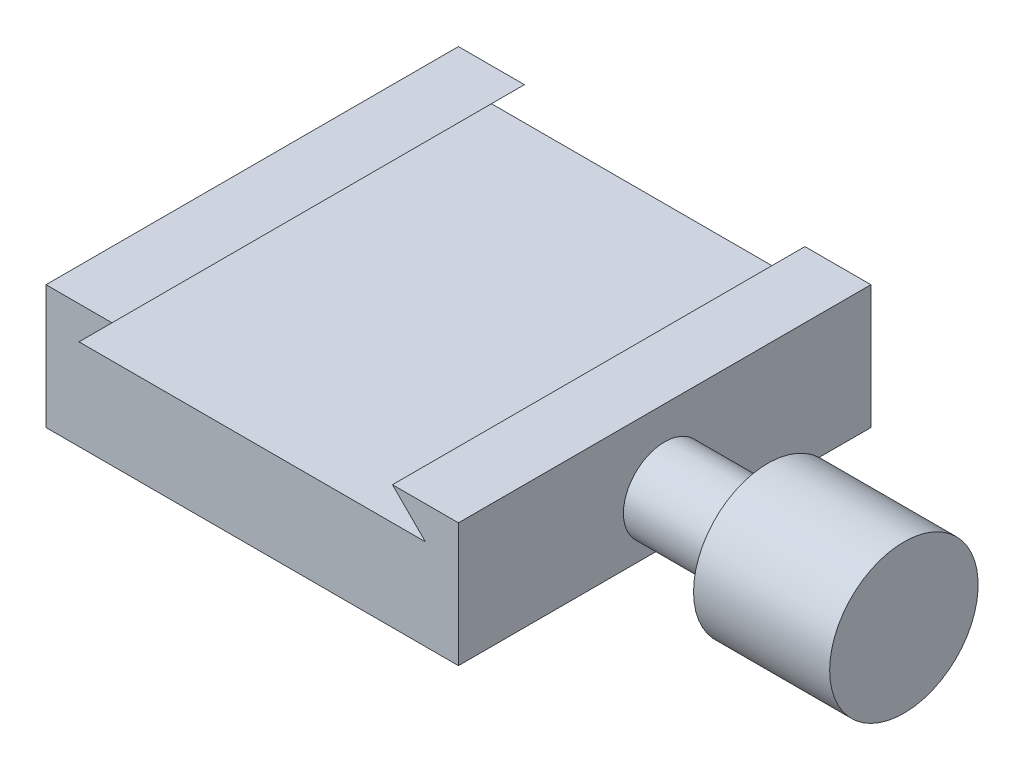
ISO-10303-21;
HEADER;
FILE_DESCRIPTION(('STEP AP214'),'2;1');
FILE_NAME('part.step','',(''),(''),'','','');
FILE_SCHEMA(('AUTOMOTIVE_DESIGN { 1 0 10303 214 1 1 1 1 }'));
ENDSEC;
DATA;
#1=APPLICATION_CONTEXT('core data for automotive mechanical design processes');
#2=APPLICATION_PROTOCOL_DEFINITION('international standard','automotive_design',2000,#1);
#3=PRODUCT_CONTEXT('',#1,'mechanical');
#4=PRODUCT('Part','Part','',(#3));
#5=PRODUCT_RELATED_PRODUCT_CATEGORY('part','',(#4));
#6=PRODUCT_DEFINITION_FORMATION('','',#4);
#7=PRODUCT_DEFINITION_CONTEXT('part definition',#1,'design');
#8=PRODUCT_DEFINITION('design','',#6,#7);
#9=PRODUCT_DEFINITION_SHAPE('','',#8);
#10=(LENGTH_UNIT() NAMED_UNIT(*) SI_UNIT(.MILLI.,.METRE.));
#11=(NAMED_UNIT(*) PLANE_ANGLE_UNIT() SI_UNIT($,.RADIAN.));
#12=(NAMED_UNIT(*) SI_UNIT($,.STERADIAN.) SOLID_ANGLE_UNIT());
#13=UNCERTAINTY_MEASURE_WITH_UNIT(LENGTH_MEASURE(1.E-05),#10,'distance_accuracy_value','');
#14=(GEOMETRIC_REPRESENTATION_CONTEXT(3) GLOBAL_UNCERTAINTY_ASSIGNED_CONTEXT((#13)) GLOBAL_UNIT_ASSIGNED_CONTEXT((#10,
#11,#12)) REPRESENTATION_CONTEXT('',''));
#15=CARTESIAN_POINT('',(0.,0.,0.));
#16=DIRECTION('',(0.,0.,1.));
#17=DIRECTION('',(1.,0.,0.));
#18=AXIS2_PLACEMENT_3D('',#15,#16,#17);
#19=CARTESIAN_POINT('',(50.,0.,50.));
#20=DIRECTION('',(0.,1.,0.));
#21=DIRECTION('',(-1.,0.,0.));
#22=AXIS2_PLACEMENT_3D('',#19,#20,#21);
#23=PLANE('',#22);
#24=CARTESIAN_POINT('',(25.,0.,25.));
#25=DIRECTION('',(0.,-1.,0.));
#26=DIRECTION('',(1.,0.,0.));
#27=AXIS2_PLACEMENT_3D('',#24,#25,#26);
#28=CIRCLE('',#27,4.7625);
#29=CARTESIAN_POINT('',(29.7625,0.,25.));
#30=VERTEX_POINT('',#29);
#31=EDGE_CURVE('E223',#30,#30,#28,.T.);
#32=ORIENTED_EDGE('',*,*,#31,.F.);
#33=EDGE_LOOP('',(#32));
#34=FACE_BOUND('',#33,.T.);
#35=DIRECTION('',(1.,0.,0.));
#36=VECTOR('',#35,1.);
#37=CARTESIAN_POINT('',(50.,0.,0.));
#38=LINE('',#37,#36);
#39=CARTESIAN_POINT('',(0.,0.,0.));
#40=VERTEX_POINT('',#39);
#41=CARTESIAN_POINT('',(50.,0.,0.));
#42=VERTEX_POINT('',#41);
#43=EDGE_CURVE('E140',#40,#42,#38,.T.);
#44=ORIENTED_EDGE('',*,*,#43,.T.);
#45=DIRECTION('',(0.,0.,-1.));
#46=VECTOR('',#45,1.);
#47=CARTESIAN_POINT('',(50.,0.,50.));
#48=LINE('',#47,#46);
#49=CARTESIAN_POINT('',(50.,0.,50.));
#50=VERTEX_POINT('',#49);
#51=EDGE_CURVE('E11',#50,#42,#48,.T.);
#52=ORIENTED_EDGE('',*,*,#51,.F.);
#53=DIRECTION('',(1.,0.,0.));
#54=VECTOR('',#53,1.);
#55=CARTESIAN_POINT('',(50.,0.,50.));
#56=LINE('',#55,#54);
#57=CARTESIAN_POINT('',(0.,0.,50.));
#58=VERTEX_POINT('',#57);
#59=EDGE_CURVE('E163',#58,#50,#56,.T.);
#60=ORIENTED_EDGE('',*,*,#59,.F.);
#61=DIRECTION('',(0.,0.,-1.));
#62=VECTOR('',#61,1.);
#63=CARTESIAN_POINT('',(0.,0.,50.));
#64=LINE('',#63,#62);
#65=EDGE_CURVE('E136',#58,#40,#64,.T.);
#66=ORIENTED_EDGE('',*,*,#65,.T.);
#67=EDGE_LOOP('',(#44,#52,#60,#66));
#68=FACE_BOUND('',#67,.T.);
#69=ADVANCED_FACE('F39',(#34,#68),#23,.F.);
#70=CARTESIAN_POINT('',(50.,15.,50.));
#71=DIRECTION('',(-1.,0.,0.));
#72=DIRECTION('',(0.,0.,1.));
#73=AXIS2_PLACEMENT_3D('',#70,#71,#72);
#74=PLANE('',#73);
#75=CARTESIAN_POINT('',(50.,6.,25.));
#76=DIRECTION('',(-1.,0.,0.));
#77=DIRECTION('',(0.,0.,1.));
#78=AXIS2_PLACEMENT_3D('',#75,#76,#77);
#79=CIRCLE('',#78,5.);
#80=CARTESIAN_POINT('',(50.,6.,30.));
#81=VERTEX_POINT('',#80);
#82=EDGE_CURVE('E145',#81,#81,#79,.T.);
#83=ORIENTED_EDGE('',*,*,#82,.T.);
#84=EDGE_LOOP('',(#83));
#85=FACE_BOUND('',#84,.T.);
#86=DIRECTION('',(0.,1.,0.));
#87=VECTOR('',#86,1.);
#88=CARTESIAN_POINT('',(50.,15.,0.));
#89=LINE('',#88,#87);
#90=CARTESIAN_POINT('',(50.,15.,0.));
#91=VERTEX_POINT('',#90);
#92=EDGE_CURVE('E144',#42,#91,#89,.T.);
#93=ORIENTED_EDGE('',*,*,#92,.T.);
#94=DIRECTION('',(0.,0.,-1.));
#95=VECTOR('',#94,1.);
#96=CARTESIAN_POINT('',(50.,15.,50.));
#97=LINE('',#96,#95);
#98=CARTESIAN_POINT('',(50.,15.,50.));
#99=VERTEX_POINT('',#98);
#100=EDGE_CURVE('E48',#99,#91,#97,.T.);
#101=ORIENTED_EDGE('',*,*,#100,.F.);
#102=DIRECTION('',(0.,1.,0.));
#103=VECTOR('',#102,1.);
#104=CARTESIAN_POINT('',(50.,15.,50.));
#105=LINE('',#104,#103);
#106=EDGE_CURVE('E99',#50,#99,#105,.T.);
#107=ORIENTED_EDGE('',*,*,#106,.F.);
#108=ORIENTED_EDGE('',*,*,#51,.T.);
#109=EDGE_LOOP('',(#93,#101,#107,#108));
#110=FACE_BOUND('',#109,.T.);
#111=ADVANCED_FACE('F242',(#85,#110),#74,.F.);
#112=CARTESIAN_POINT('',(42.,15.,50.));
#113=DIRECTION('',(0.,-1.,0.));
#114=DIRECTION('',(0.,0.,-1.));
#115=AXIS2_PLACEMENT_3D('',#112,#113,#114);
#116=PLANE('',#115);
#117=DIRECTION('',(-1.,0.,0.));
#118=VECTOR('',#117,1.);
#119=CARTESIAN_POINT('',(42.,15.,0.));
#120=LINE('',#119,#118);
#121=CARTESIAN_POINT('',(42.,15.,0.));
#122=VERTEX_POINT('',#121);
#123=EDGE_CURVE('E148',#91,#122,#120,.T.);
#124=ORIENTED_EDGE('',*,*,#123,.T.);
#125=DIRECTION('',(0.,0.,-1.));
#126=VECTOR('',#125,1.);
#127=CARTESIAN_POINT('',(42.,15.,50.));
#128=LINE('',#127,#126);
#129=CARTESIAN_POINT('',(42.,15.,50.));
#130=VERTEX_POINT('',#129);
#131=EDGE_CURVE('E174',#130,#122,#128,.T.);
#132=ORIENTED_EDGE('',*,*,#131,.F.);
#133=DIRECTION('',(-1.,0.,0.));
#134=VECTOR('',#133,1.);
#135=CARTESIAN_POINT('',(42.,15.,50.));
#136=LINE('',#135,#134);
#137=EDGE_CURVE('E184',#99,#130,#136,.T.);
#138=ORIENTED_EDGE('',*,*,#137,.F.);
#139=ORIENTED_EDGE('',*,*,#100,.T.);
#140=EDGE_LOOP('',(#124,#132,#138,#139));
#141=FACE_BOUND('',#140,.T.);
#142=ADVANCED_FACE('F182',(#141),#116,.F.);
#143=CARTESIAN_POINT('',(46.,11.,50.));
#144=DIRECTION('',(0.707106781186548,0.707106781186547,0.));
#145=DIRECTION('',(-0.707106781186547,0.707106781186548,0.));
#146=AXIS2_PLACEMENT_3D('',#143,#144,#145);
#147=PLANE('',#146);
#148=DIRECTION('',(0.707106781186547,-0.707106781186548,0.));
#149=VECTOR('',#148,1.);
#150=CARTESIAN_POINT('',(46.,11.,0.));
#151=LINE('',#150,#149);
#152=CARTESIAN_POINT('',(46.,11.,0.));
#153=VERTEX_POINT('',#152);
#154=EDGE_CURVE('E151',#122,#153,#151,.T.);
#155=ORIENTED_EDGE('',*,*,#154,.T.);
#156=DIRECTION('',(0.,0.,-1.));
#157=VECTOR('',#156,1.);
#158=CARTESIAN_POINT('',(46.,11.,50.));
#159=LINE('',#158,#157);
#160=CARTESIAN_POINT('',(46.,11.,50.));
#161=VERTEX_POINT('',#160);
#162=EDGE_CURVE('E170',#161,#153,#159,.T.);
#163=ORIENTED_EDGE('',*,*,#162,.F.);
#164=DIRECTION('',(0.707106781186547,-0.707106781186548,0.));
#165=VECTOR('',#164,1.);
#166=CARTESIAN_POINT('',(46.,11.,50.));
#167=LINE('',#166,#165);
#168=EDGE_CURVE('E197',#130,#161,#167,.T.);
#169=ORIENTED_EDGE('',*,*,#168,.F.);
#170=ORIENTED_EDGE('',*,*,#131,.T.);
#171=EDGE_LOOP('',(#155,#163,#169,#170));
#172=FACE_BOUND('',#171,.T.);
#173=ADVANCED_FACE('F192',(#172),#147,.F.);
#174=CARTESIAN_POINT('',(4.,11.,50.));
#175=DIRECTION('',(0.,-1.,0.));
#176=DIRECTION('',(0.,0.,-1.));
#177=AXIS2_PLACEMENT_3D('',#174,#175,#176);
#178=PLANE('',#177);
#179=DIRECTION('',(-1.,0.,0.));
#180=VECTOR('',#179,1.);
#181=CARTESIAN_POINT('',(4.,11.,0.));
#182=LINE('',#181,#180);
#183=CARTESIAN_POINT('',(4.,11.,0.));
#184=VERTEX_POINT('',#183);
#185=EDGE_CURVE('E154',#153,#184,#182,.T.);
#186=ORIENTED_EDGE('',*,*,#185,.T.);
#187=DIRECTION('',(0.,0.,-1.));
#188=VECTOR('',#187,1.);
#189=CARTESIAN_POINT('',(4.,11.,50.));
#190=LINE('',#189,#188);
#191=CARTESIAN_POINT('',(4.,11.,50.));
#192=VERTEX_POINT('',#191);
#193=EDGE_CURVE('E129',#192,#184,#190,.T.);
#194=ORIENTED_EDGE('',*,*,#193,.F.);
#195=DIRECTION('',(-1.,0.,0.));
#196=VECTOR('',#195,1.);
#197=CARTESIAN_POINT('',(4.,11.,50.));
#198=LINE('',#197,#196);
#199=EDGE_CURVE('E118',#161,#192,#198,.T.);
#200=ORIENTED_EDGE('',*,*,#199,.F.);
#201=ORIENTED_EDGE('',*,*,#162,.T.);
#202=EDGE_LOOP('',(#186,#194,#200,#201));
#203=FACE_BOUND('',#202,.T.);
#204=ADVANCED_FACE('F195',(#203),#178,.F.);
#205=CARTESIAN_POINT('',(8.,15.,50.));
#206=DIRECTION('',(-0.707106781186548,0.707106781186548,0.));
#207=DIRECTION('',(-0.707106781186548,-0.707106781186548,0.));
#208=AXIS2_PLACEMENT_3D('',#205,#206,#207);
#209=PLANE('',#208);
#210=DIRECTION('',(0.707106781186548,0.707106781186548,0.));
#211=VECTOR('',#210,1.);
#212=CARTESIAN_POINT('',(8.,15.,0.));
#213=LINE('',#212,#211);
#214=CARTESIAN_POINT('',(8.,15.,0.));
#215=VERTEX_POINT('',#214);
#216=EDGE_CURVE('E127',#184,#215,#213,.T.);
#217=ORIENTED_EDGE('',*,*,#216,.T.);
#218=DIRECTION('',(0.,0.,-1.));
#219=VECTOR('',#218,1.);
#220=CARTESIAN_POINT('',(8.,15.,50.));
#221=LINE('',#220,#219);
#222=CARTESIAN_POINT('',(8.,15.,50.));
#223=VERTEX_POINT('',#222);
#224=EDGE_CURVE('E124',#223,#215,#221,.T.);
#225=ORIENTED_EDGE('',*,*,#224,.F.);
#226=DIRECTION('',(0.707106781186548,0.707106781186548,0.));
#227=VECTOR('',#226,1.);
#228=CARTESIAN_POINT('',(8.,15.,50.));
#229=LINE('',#228,#227);
#230=EDGE_CURVE('E112',#192,#223,#229,.T.);
#231=ORIENTED_EDGE('',*,*,#230,.F.);
#232=ORIENTED_EDGE('',*,*,#193,.T.);
#233=EDGE_LOOP('',(#217,#225,#231,#232));
#234=FACE_BOUND('',#233,.T.);
#235=ADVANCED_FACE('F125',(#234),#209,.F.);
#236=CARTESIAN_POINT('',(0.,15.,50.));
#237=DIRECTION('',(0.,-1.,0.));
#238=DIRECTION('',(0.,0.,-1.));
#239=AXIS2_PLACEMENT_3D('',#236,#237,#238);
#240=PLANE('',#239);
#241=DIRECTION('',(-1.,0.,0.));
#242=VECTOR('',#241,1.);
#243=CARTESIAN_POINT('',(0.,15.,0.));
#244=LINE('',#243,#242);
#245=CARTESIAN_POINT('',(0.,15.,0.));
#246=VERTEX_POINT('',#245);
#247=EDGE_CURVE('E85',#215,#246,#244,.T.);
#248=ORIENTED_EDGE('',*,*,#247,.T.);
#249=DIRECTION('',(0.,0.,-1.));
#250=VECTOR('',#249,1.);
#251=CARTESIAN_POINT('',(0.,15.,50.));
#252=LINE('',#251,#250);
#253=CARTESIAN_POINT('',(0.,15.,50.));
#254=VERTEX_POINT('',#253);
#255=EDGE_CURVE('E130',#254,#246,#252,.T.);
#256=ORIENTED_EDGE('',*,*,#255,.F.);
#257=DIRECTION('',(-1.,0.,0.));
#258=VECTOR('',#257,1.);
#259=CARTESIAN_POINT('',(0.,15.,50.));
#260=LINE('',#259,#258);
#261=EDGE_CURVE('E116',#223,#254,#260,.T.);
#262=ORIENTED_EDGE('',*,*,#261,.F.);
#263=ORIENTED_EDGE('',*,*,#224,.T.);
#264=EDGE_LOOP('',(#248,#256,#262,#263));
#265=FACE_BOUND('',#264,.T.);
#266=ADVANCED_FACE('F132',(#265),#240,.F.);
#267=CARTESIAN_POINT('',(0.,0.,50.));
#268=DIRECTION('',(1.,0.,0.));
#269=DIRECTION('',(0.,0.,-1.));
#270=AXIS2_PLACEMENT_3D('',#267,#268,#269);
#271=PLANE('',#270);
#272=DIRECTION('',(0.,-1.,0.));
#273=VECTOR('',#272,1.);
#274=CARTESIAN_POINT('',(0.,0.,0.));
#275=LINE('',#274,#273);
#276=EDGE_CURVE('E91',#246,#40,#275,.T.);
#277=ORIENTED_EDGE('',*,*,#276,.T.);
#278=ORIENTED_EDGE('',*,*,#65,.F.);
#279=DIRECTION('',(0.,-1.,0.));
#280=VECTOR('',#279,1.);
#281=CARTESIAN_POINT('',(0.,0.,50.));
#282=LINE('',#281,#280);
#283=EDGE_CURVE('E56',#254,#58,#282,.T.);
#284=ORIENTED_EDGE('',*,*,#283,.F.);
#285=ORIENTED_EDGE('',*,*,#255,.T.);
#286=EDGE_LOOP('',(#277,#278,#284,#285));
#287=FACE_BOUND('',#286,.T.);
#288=ADVANCED_FACE('F245',(#287),#271,.F.);
#289=CARTESIAN_POINT('',(0.,0.,50.));
#290=DIRECTION('',(0.,0.,-1.));
#291=DIRECTION('',(-1.,0.,0.));
#292=AXIS2_PLACEMENT_3D('',#289,#290,#291);
#293=PLANE('',#292);
#294=ORIENTED_EDGE('',*,*,#59,.T.);
#295=ORIENTED_EDGE('',*,*,#106,.T.);
#296=ORIENTED_EDGE('',*,*,#137,.T.);
#297=ORIENTED_EDGE('',*,*,#168,.T.);
#298=ORIENTED_EDGE('',*,*,#199,.T.);
#299=ORIENTED_EDGE('',*,*,#230,.T.);
#300=ORIENTED_EDGE('',*,*,#261,.T.);
#301=ORIENTED_EDGE('',*,*,#283,.T.);
#302=EDGE_LOOP('',(#294,#295,#296,#297,#298,#299,#300,#301));
#303=FACE_BOUND('',#302,.T.);
#304=ADVANCED_FACE('F114',(#303),#293,.F.);
#305=CARTESIAN_POINT('',(0.,0.,0.));
#306=DIRECTION('',(0.,0.,-1.));
#307=DIRECTION('',(-1.,0.,0.));
#308=AXIS2_PLACEMENT_3D('',#305,#306,#307);
#309=PLANE('',#308);
#310=ORIENTED_EDGE('',*,*,#43,.F.);
#311=ORIENTED_EDGE('',*,*,#276,.F.);
#312=ORIENTED_EDGE('',*,*,#247,.F.);
#313=ORIENTED_EDGE('',*,*,#216,.F.);
#314=ORIENTED_EDGE('',*,*,#185,.F.);
#315=ORIENTED_EDGE('',*,*,#154,.F.);
#316=ORIENTED_EDGE('',*,*,#123,.F.);
#317=ORIENTED_EDGE('',*,*,#92,.F.);
#318=EDGE_LOOP('',(#310,#311,#312,#313,#314,#315,#316,#317));
#319=FACE_BOUND('',#318,.T.);
#320=ADVANCED_FACE('F188',(#319),#309,.T.);
#321=CARTESIAN_POINT('',(50.,6.,25.));
#322=DIRECTION('',(-1.,0.,0.));
#323=DIRECTION('',(0.,0.,1.));
#324=AXIS2_PLACEMENT_3D('',#321,#322,#323);
#325=CYLINDRICAL_SURFACE('',#324,5.);
#326=CARTESIAN_POINT('',(62.5,6.,25.));
#327=DIRECTION('',(-1.,0.,0.));
#328=DIRECTION('',(0.,0.,1.));
#329=AXIS2_PLACEMENT_3D('',#326,#327,#328);
#330=CIRCLE('',#329,5.);
#331=CARTESIAN_POINT('',(62.5,6.,30.));
#332=VERTEX_POINT('',#331);
#333=EDGE_CURVE('E218',#332,#332,#330,.T.);
#334=ORIENTED_EDGE('',*,*,#333,.T.);
#335=EDGE_LOOP('',(#334));
#336=FACE_BOUND('',#335,.T.);
#337=ORIENTED_EDGE('',*,*,#82,.F.);
#338=EDGE_LOOP('',(#337));
#339=FACE_BOUND('',#338,.T.);
#340=ADVANCED_FACE('F269',(#336,#339),#325,.T.);
#341=CARTESIAN_POINT('',(79.,-3.,25.));
#342=DIRECTION('',(1.,0.,0.));
#343=DIRECTION('',(0.,0.,-1.));
#344=AXIS2_PLACEMENT_3D('',#341,#342,#343);
#345=PLANE('',#344);
#346=CARTESIAN_POINT('',(79.,6.,25.));
#347=DIRECTION('',(-1.,0.,0.));
#348=DIRECTION('',(0.,0.,1.));
#349=AXIS2_PLACEMENT_3D('',#346,#347,#348);
#350=CIRCLE('',#349,9.);
#351=CARTESIAN_POINT('',(79.,6.,34.));
#352=VERTEX_POINT('',#351);
#353=EDGE_CURVE('E210',#352,#352,#350,.T.);
#354=ORIENTED_EDGE('',*,*,#353,.F.);
#355=EDGE_LOOP('',(#354));
#356=FACE_BOUND('',#355,.T.);
#357=ADVANCED_FACE('F271',(#356),#345,.T.);
#358=CARTESIAN_POINT('',(50.,6.,25.));
#359=DIRECTION('',(-1.,0.,0.));
#360=DIRECTION('',(0.,0.,1.));
#361=AXIS2_PLACEMENT_3D('',#358,#359,#360);
#362=CYLINDRICAL_SURFACE('',#361,9.);
#363=ORIENTED_EDGE('',*,*,#353,.T.);
#364=EDGE_LOOP('',(#363));
#365=FACE_BOUND('',#364,.T.);
#366=CARTESIAN_POINT('',(62.5,6.,25.));
#367=DIRECTION('',(-1.,0.,0.));
#368=DIRECTION('',(0.,0.,1.));
#369=AXIS2_PLACEMENT_3D('',#366,#367,#368);
#370=CIRCLE('',#369,9.);
#371=CARTESIAN_POINT('',(62.5,6.,34.));
#372=VERTEX_POINT('',#371);
#373=EDGE_CURVE('E214',#372,#372,#370,.T.);
#374=ORIENTED_EDGE('',*,*,#373,.F.);
#375=EDGE_LOOP('',(#374));
#376=FACE_BOUND('',#375,.T.);
#377=ADVANCED_FACE('F278',(#365,#376),#362,.T.);
#378=CARTESIAN_POINT('',(62.5,1.,25.));
#379=DIRECTION('',(-1.,0.,0.));
#380=DIRECTION('',(0.,0.,1.));
#381=AXIS2_PLACEMENT_3D('',#378,#379,#380);
#382=PLANE('',#381);
#383=ORIENTED_EDGE('',*,*,#373,.T.);
#384=EDGE_LOOP('',(#383));
#385=FACE_BOUND('',#384,.T.);
#386=ORIENTED_EDGE('',*,*,#333,.F.);
#387=EDGE_LOOP('',(#386));
#388=FACE_BOUND('',#387,.T.);
#389=ADVANCED_FACE('F236',(#385,#388),#382,.T.);
#390=CARTESIAN_POINT('',(25.,6.35,25.));
#391=DIRECTION('',(0.,-1.,0.));
#392=DIRECTION('',(1.,0.,0.));
#393=AXIS2_PLACEMENT_3D('',#390,#391,#392);
#394=CYLINDRICAL_SURFACE('',#393,4.7625);
#395=CARTESIAN_POINT('',(25.,6.35,25.));
#396=DIRECTION('',(0.,-1.,0.));
#397=DIRECTION('',(1.,0.,0.));
#398=AXIS2_PLACEMENT_3D('',#395,#396,#397);
#399=CIRCLE('',#398,4.7625);
#400=CARTESIAN_POINT('',(29.7625,6.35,25.));
#401=VERTEX_POINT('',#400);
#402=EDGE_CURVE('E222',#401,#401,#399,.T.);
#403=ORIENTED_EDGE('',*,*,#402,.F.);
#404=EDGE_LOOP('',(#403));
#405=FACE_BOUND('',#404,.T.);
#406=ORIENTED_EDGE('',*,*,#31,.T.);
#407=EDGE_LOOP('',(#406));
#408=FACE_BOUND('',#407,.T.);
#409=ADVANCED_FACE('F233',(#405,#408),#394,.F.);
#410=CARTESIAN_POINT('',(25.,6.35,25.));
#411=DIRECTION('',(0.,-1.,0.));
#412=DIRECTION('',(1.,0.,0.));
#413=AXIS2_PLACEMENT_3D('',#410,#411,#412);
#414=PLANE('',#413);
#415=ORIENTED_EDGE('',*,*,#402,.T.);
#416=EDGE_LOOP('',(#415));
#417=FACE_BOUND('',#416,.T.);
#418=ADVANCED_FACE('F231',(#417),#414,.T.);
#419=CLOSED_SHELL('',(#69,#111,#142,#173,#204,#235,#266,#288,#304,#320,#340,#357,#377,#389,#409,#418));
#420=MANIFOLD_SOLID_BREP('B2',#419);
#421=ADVANCED_BREP_SHAPE_REPRESENTATION('',(#18,#420),#14);
#422=SHAPE_DEFINITION_REPRESENTATION(#9,#421);
ENDSEC;
END-ISO-10303-21;
